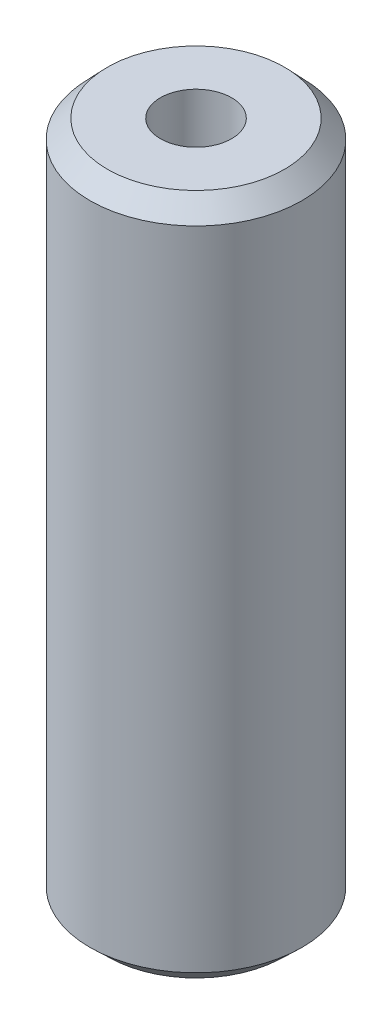
ISO-10303-21;
HEADER;
FILE_DESCRIPTION(('STEP AP214'),'2;1');
FILE_NAME('part.step','',(''),(''),'','','');
FILE_SCHEMA(('AUTOMOTIVE_DESIGN { 1 0 10303 214 1 1 1 1 }'));
ENDSEC;
DATA;
#1=APPLICATION_CONTEXT('core data for automotive mechanical design processes');
#2=APPLICATION_PROTOCOL_DEFINITION('international standard','automotive_design',2000,#1);
#3=PRODUCT_CONTEXT('',#1,'mechanical');
#4=PRODUCT('Part','Part','',(#3));
#5=PRODUCT_RELATED_PRODUCT_CATEGORY('part','',(#4));
#6=PRODUCT_DEFINITION_FORMATION('','',#4);
#7=PRODUCT_DEFINITION_CONTEXT('part definition',#1,'design');
#8=PRODUCT_DEFINITION('design','',#6,#7);
#9=PRODUCT_DEFINITION_SHAPE('','',#8);
#10=(LENGTH_UNIT() NAMED_UNIT(*) SI_UNIT(.MILLI.,.METRE.));
#11=(NAMED_UNIT(*) PLANE_ANGLE_UNIT() SI_UNIT($,.RADIAN.));
#12=(NAMED_UNIT(*) SI_UNIT($,.STERADIAN.) SOLID_ANGLE_UNIT());
#13=UNCERTAINTY_MEASURE_WITH_UNIT(LENGTH_MEASURE(1.E-05),#10,'distance_accuracy_value','');
#14=(GEOMETRIC_REPRESENTATION_CONTEXT(3) GLOBAL_UNCERTAINTY_ASSIGNED_CONTEXT((#13)) GLOBAL_UNIT_ASSIGNED_CONTEXT((#10,
#11,#12)) REPRESENTATION_CONTEXT('',''));
#15=CARTESIAN_POINT('',(0.,0.,0.));
#16=DIRECTION('',(0.,0.,1.));
#17=DIRECTION('',(1.,0.,0.));
#18=AXIS2_PLACEMENT_3D('',#15,#16,#17);
#19=CARTESIAN_POINT('',(0.,80.4844479840713,0.));
#20=DIRECTION('',(0.,-1.,0.));
#21=DIRECTION('',(0.,0.,-1.));
#22=AXIS2_PLACEMENT_3D('',#19,#20,#21);
#23=CYLINDRICAL_SURFACE('',#22,12.5);
#24=CARTESIAN_POINT('',(0.,78.3171732880882,0.));
#25=DIRECTION('',(0.,1.,0.));
#26=DIRECTION('',(0.,0.,1.));
#27=AXIS2_PLACEMENT_3D('',#24,#25,#26);
#28=CIRCLE('',#27,12.5);
#29=CARTESIAN_POINT('',(0.,78.3171732880882,12.5));
#30=VERTEX_POINT('',#29);
#31=EDGE_CURVE('E50',#30,#30,#28,.F.);
#32=ORIENTED_EDGE('',*,*,#31,.T.);
#33=EDGE_LOOP('',(#32));
#34=FACE_BOUND('',#33,.T.);
#35=CARTESIAN_POINT('',(0.,2.06202641066036,0.));
#36=DIRECTION('',(0.,1.,0.));
#37=DIRECTION('',(0.,0.,1.));
#38=AXIS2_PLACEMENT_3D('',#35,#36,#37);
#39=CIRCLE('',#38,12.5);
#40=CARTESIAN_POINT('',(0.,2.06202641066036,12.5));
#41=VERTEX_POINT('',#40);
#42=EDGE_CURVE('E51',#41,#41,#39,.T.);
#43=ORIENTED_EDGE('',*,*,#42,.T.);
#44=EDGE_LOOP('',(#43));
#45=FACE_BOUND('',#44,.T.);
#46=ADVANCED_FACE('F39',(#34,#45),#23,.T.);
#47=CARTESIAN_POINT('',(0.,80.4844479840713,0.));
#48=DIRECTION('',(0.,1.,0.));
#49=DIRECTION('',(0.,0.,1.));
#50=AXIS2_PLACEMENT_3D('',#47,#48,#49);
#51=PLANE('',#50);
#52=CARTESIAN_POINT('',(0.,80.4844479840713,0.));
#53=DIRECTION('',(0.,1.,0.));
#54=DIRECTION('',(0.,0.,1.));
#55=AXIS2_PLACEMENT_3D('',#52,#53,#54);
#56=CIRCLE('',#55,10.4379735893397);
#57=CARTESIAN_POINT('',(0.,80.4844479840713,10.4379735893397));
#58=VERTEX_POINT('',#57);
#59=EDGE_CURVE('E54',#58,#58,#56,.T.);
#60=ORIENTED_EDGE('',*,*,#59,.T.);
#61=EDGE_LOOP('',(#60));
#62=FACE_BOUND('',#61,.T.);
#63=CARTESIAN_POINT('',(0.,80.4844479840713,0.));
#64=DIRECTION('',(0.,1.,0.));
#65=DIRECTION('',(0.,0.,1.));
#66=AXIS2_PLACEMENT_3D('',#63,#64,#65);
#67=CIRCLE('',#66,4.19646460700942);
#68=CARTESIAN_POINT('',(0.,80.4844479840713,4.19646460700942));
#69=VERTEX_POINT('',#68);
#70=EDGE_CURVE('E58',#69,#69,#67,.T.);
#71=ORIENTED_EDGE('',*,*,#70,.F.);
#72=EDGE_LOOP('',(#71));
#73=FACE_BOUND('',#72,.T.);
#74=ADVANCED_FACE('F69',(#62,#73),#51,.T.);
#75=CARTESIAN_POINT('',(0.,0.,0.));
#76=DIRECTION('',(0.,1.,0.));
#77=DIRECTION('',(0.,0.,1.));
#78=AXIS2_PLACEMENT_3D('',#75,#76,#77);
#79=PLANE('',#78);
#80=CARTESIAN_POINT('',(0.,0.,0.));
#81=DIRECTION('',(0.,1.,0.));
#82=DIRECTION('',(0.,0.,1.));
#83=AXIS2_PLACEMENT_3D('',#80,#81,#82);
#84=CIRCLE('',#83,10.3327253040169);
#85=CARTESIAN_POINT('',(0.,0.,10.3327253040169));
#86=VERTEX_POINT('',#85);
#87=EDGE_CURVE('E10',#86,#86,#84,.F.);
#88=ORIENTED_EDGE('',*,*,#87,.T.);
#89=EDGE_LOOP('',(#88));
#90=FACE_BOUND('',#89,.T.);
#91=CARTESIAN_POINT('',(0.,0.,0.));
#92=DIRECTION('',(0.,1.,0.));
#93=DIRECTION('',(0.,0.,1.));
#94=AXIS2_PLACEMENT_3D('',#91,#92,#93);
#95=CIRCLE('',#94,4.19646460700942);
#96=CARTESIAN_POINT('',(0.,0.,4.19646460700942));
#97=VERTEX_POINT('',#96);
#98=EDGE_CURVE('E63',#97,#97,#95,.T.);
#99=ORIENTED_EDGE('',*,*,#98,.T.);
#100=EDGE_LOOP('',(#99));
#101=FACE_BOUND('',#100,.T.);
#102=ADVANCED_FACE('F75',(#90,#101),#79,.F.);
#103=CARTESIAN_POINT('',(0.,80.4844479840713,0.));
#104=DIRECTION('',(0.,-1.,0.));
#105=DIRECTION('',(0.,0.,-1.));
#106=AXIS2_PLACEMENT_3D('',#103,#104,#105);
#107=CYLINDRICAL_SURFACE('',#106,4.19646460700942);
#108=ORIENTED_EDGE('',*,*,#70,.T.);
#109=EDGE_LOOP('',(#108));
#110=FACE_BOUND('',#109,.T.);
#111=ORIENTED_EDGE('',*,*,#98,.F.);
#112=EDGE_LOOP('',(#111));
#113=FACE_BOUND('',#112,.T.);
#114=ADVANCED_FACE('F70',(#110,#113),#107,.F.);
#115=CARTESIAN_POINT('',(0.,80.4844479840713,0.));
#116=DIRECTION('',(0.,-1.,0.));
#117=DIRECTION('',(0.,0.,-1.));
#118=AXIS2_PLACEMENT_3D('',#115,#116,#117);
#119=CONICAL_SURFACE('',#118,10.4379735893397,0.760517795602314);
#120=ORIENTED_EDGE('',*,*,#31,.F.);
#121=EDGE_LOOP('',(#120));
#122=FACE_BOUND('',#121,.T.);
#123=ORIENTED_EDGE('',*,*,#59,.F.);
#124=EDGE_LOOP('',(#123));
#125=FACE_BOUND('',#124,.T.);
#126=ADVANCED_FACE('F81',(#122,#125),#119,.T.);
#127=CARTESIAN_POINT('',(0.,2.06202641066036,0.));
#128=DIRECTION('',(0.,1.,0.));
#129=DIRECTION('',(0.,0.,1.));
#130=AXIS2_PLACEMENT_3D('',#127,#128,#129);
#131=CONICAL_SURFACE('',#130,12.5,0.810278531192583);
#132=ORIENTED_EDGE('',*,*,#87,.F.);
#133=EDGE_LOOP('',(#132));
#134=FACE_BOUND('',#133,.T.);
#135=ORIENTED_EDGE('',*,*,#42,.F.);
#136=EDGE_LOOP('',(#135));
#137=FACE_BOUND('',#136,.T.);
#138=ADVANCED_FACE('F45',(#134,#137),#131,.T.);
#139=CLOSED_SHELL('',(#46,#74,#102,#114,#126,#138));
#140=MANIFOLD_SOLID_BREP('B2',#139);
#141=ADVANCED_BREP_SHAPE_REPRESENTATION('',(#18,#140),#14);
#142=SHAPE_DEFINITION_REPRESENTATION(#9,#141);
ENDSEC;
END-ISO-10303-21;
